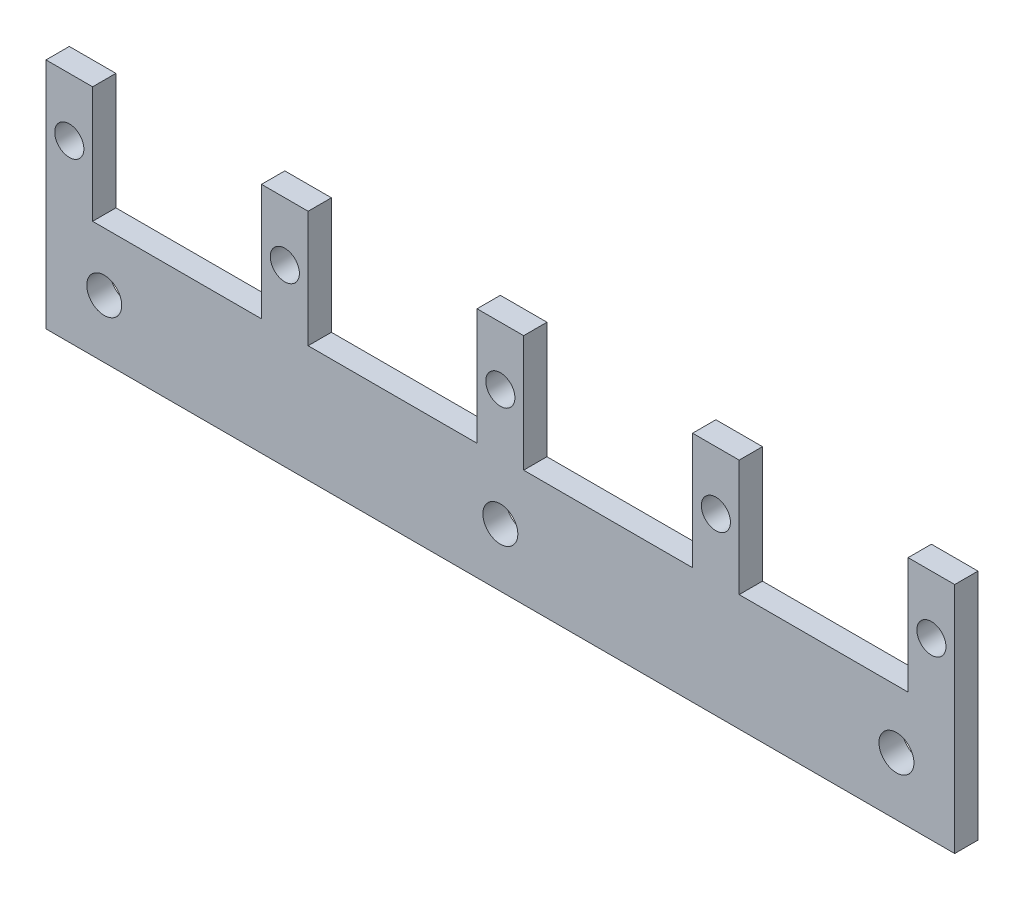
ISO-10303-21;
HEADER;
FILE_DESCRIPTION(('STEP AP214'),'2;1');
FILE_NAME('part.step','',(''),(''),'','','');
FILE_SCHEMA(('AUTOMOTIVE_DESIGN { 1 0 10303 214 1 1 1 1 }'));
ENDSEC;
DATA;
#1=APPLICATION_CONTEXT('core data for automotive mechanical design processes');
#2=APPLICATION_PROTOCOL_DEFINITION('international standard','automotive_design',2000,#1);
#3=PRODUCT_CONTEXT('',#1,'mechanical');
#4=PRODUCT('Part','Part','',(#3));
#5=PRODUCT_RELATED_PRODUCT_CATEGORY('part','',(#4));
#6=PRODUCT_DEFINITION_FORMATION('','',#4);
#7=PRODUCT_DEFINITION_CONTEXT('part definition',#1,'design');
#8=PRODUCT_DEFINITION('design','',#6,#7);
#9=PRODUCT_DEFINITION_SHAPE('','',#8);
#10=(LENGTH_UNIT() NAMED_UNIT(*) SI_UNIT(.MILLI.,.METRE.));
#11=(NAMED_UNIT(*) PLANE_ANGLE_UNIT() SI_UNIT($,.RADIAN.));
#12=(NAMED_UNIT(*) SI_UNIT($,.STERADIAN.) SOLID_ANGLE_UNIT());
#13=UNCERTAINTY_MEASURE_WITH_UNIT(LENGTH_MEASURE(1.E-05),#10,'distance_accuracy_value','');
#14=(GEOMETRIC_REPRESENTATION_CONTEXT(3) GLOBAL_UNCERTAINTY_ASSIGNED_CONTEXT((#13)) GLOBAL_UNIT_ASSIGNED_CONTEXT((#10,
#11,#12)) REPRESENTATION_CONTEXT('',''));
#15=CARTESIAN_POINT('',(0.,0.,0.));
#16=DIRECTION('',(0.,0.,1.));
#17=DIRECTION('',(1.,0.,0.));
#18=AXIS2_PLACEMENT_3D('',#15,#16,#17);
#19=CARTESIAN_POINT('',(102.,22.4427767354591,-2.));
#20=DIRECTION('',(0.,0.,1.));
#21=DIRECTION('',(1.,0.,0.));
#22=AXIS2_PLACEMENT_3D('',#19,#20,#21);
#23=CYLINDRICAL_SURFACE('',#22,2.5);
#24=CARTESIAN_POINT('',(102.,22.4427767354591,-2.));
#25=DIRECTION('',(0.,0.,1.));
#26=DIRECTION('',(1.,0.,0.));
#27=AXIS2_PLACEMENT_3D('',#24,#25,#26);
#28=CIRCLE('',#27,2.5);
#29=CARTESIAN_POINT('',(104.5,22.4427767354591,-2.));
#30=VERTEX_POINT('',#29);
#31=EDGE_CURVE('E54',#30,#30,#28,.T.);
#32=ORIENTED_EDGE('',*,*,#31,.F.);
#33=EDGE_LOOP('',(#32));
#34=FACE_BOUND('',#33,.T.);
#35=CARTESIAN_POINT('',(102.,22.4427767354591,2.));
#36=DIRECTION('',(0.,0.,1.));
#37=DIRECTION('',(1.,0.,0.));
#38=AXIS2_PLACEMENT_3D('',#35,#36,#37);
#39=CIRCLE('',#38,2.5);
#40=CARTESIAN_POINT('',(104.5,22.4427767354591,2.));
#41=VERTEX_POINT('',#40);
#42=EDGE_CURVE('E11',#41,#41,#39,.T.);
#43=ORIENTED_EDGE('',*,*,#42,.T.);
#44=EDGE_LOOP('',(#43));
#45=FACE_BOUND('',#44,.T.);
#46=ADVANCED_FACE('F45',(#34,#45),#23,.F.);
#47=CARTESIAN_POINT('',(65.,22.4427767354591,-2.));
#48=DIRECTION('',(0.,0.,1.));
#49=DIRECTION('',(1.,0.,0.));
#50=AXIS2_PLACEMENT_3D('',#47,#48,#49);
#51=CYLINDRICAL_SURFACE('',#50,2.5);
#52=CARTESIAN_POINT('',(65.,22.4427767354591,-2.));
#53=DIRECTION('',(0.,0.,1.));
#54=DIRECTION('',(1.,0.,0.));
#55=AXIS2_PLACEMENT_3D('',#52,#53,#54);
#56=CIRCLE('',#55,2.5);
#57=CARTESIAN_POINT('',(67.5,22.4427767354591,-2.));
#58=VERTEX_POINT('',#57);
#59=EDGE_CURVE('E352',#58,#58,#56,.T.);
#60=ORIENTED_EDGE('',*,*,#59,.F.);
#61=EDGE_LOOP('',(#60));
#62=FACE_BOUND('',#61,.T.);
#63=CARTESIAN_POINT('',(65.,22.4427767354591,2.));
#64=DIRECTION('',(0.,0.,1.));
#65=DIRECTION('',(1.,0.,0.));
#66=AXIS2_PLACEMENT_3D('',#63,#64,#65);
#67=CIRCLE('',#66,2.5);
#68=CARTESIAN_POINT('',(67.5,22.4427767354591,2.));
#69=VERTEX_POINT('',#68);
#70=EDGE_CURVE('E356',#69,#69,#67,.T.);
#71=ORIENTED_EDGE('',*,*,#70,.T.);
#72=EDGE_LOOP('',(#71));
#73=FACE_BOUND('',#72,.T.);
#74=ADVANCED_FACE('F367',(#62,#73),#51,.F.);
#75=CARTESIAN_POINT('',(28.,22.4427767354591,-2.));
#76=DIRECTION('',(0.,0.,1.));
#77=DIRECTION('',(1.,0.,0.));
#78=AXIS2_PLACEMENT_3D('',#75,#76,#77);
#79=CYLINDRICAL_SURFACE('',#78,2.5);
#80=CARTESIAN_POINT('',(28.,22.4427767354591,-2.));
#81=DIRECTION('',(0.,0.,1.));
#82=DIRECTION('',(1.,0.,0.));
#83=AXIS2_PLACEMENT_3D('',#80,#81,#82);
#84=CIRCLE('',#83,2.5);
#85=CARTESIAN_POINT('',(30.5,22.4427767354591,-2.));
#86=VERTEX_POINT('',#85);
#87=EDGE_CURVE('E344',#86,#86,#84,.T.);
#88=ORIENTED_EDGE('',*,*,#87,.F.);
#89=EDGE_LOOP('',(#88));
#90=FACE_BOUND('',#89,.T.);
#91=CARTESIAN_POINT('',(28.,22.4427767354591,2.));
#92=DIRECTION('',(0.,0.,1.));
#93=DIRECTION('',(1.,0.,0.));
#94=AXIS2_PLACEMENT_3D('',#91,#92,#93);
#95=CIRCLE('',#94,2.5);
#96=CARTESIAN_POINT('',(30.5,22.4427767354591,2.));
#97=VERTEX_POINT('',#96);
#98=EDGE_CURVE('E348',#97,#97,#95,.T.);
#99=ORIENTED_EDGE('',*,*,#98,.T.);
#100=EDGE_LOOP('',(#99));
#101=FACE_BOUND('',#100,.T.);
#102=ADVANCED_FACE('F448',(#90,#101),#79,.F.);
#103=CARTESIAN_POINT('',(0.,-7.55722326454034,2.));
#104=DIRECTION('',(0.,1.,0.));
#105=DIRECTION('',(0.,0.,1.));
#106=AXIS2_PLACEMENT_3D('',#103,#104,#105);
#107=PLANE('',#106);
#108=DIRECTION('',(1.,0.,0.));
#109=VECTOR('',#108,1.);
#110=CARTESIAN_POINT('',(0.,-7.55722326454034,-2.));
#111=LINE('',#110,#109);
#112=CARTESIAN_POINT('',(-50.,-7.55722326454034,-2.));
#113=VERTEX_POINT('',#112);
#114=CARTESIAN_POINT('',(106.,-7.55722326454034,-2.));
#115=VERTEX_POINT('',#114);
#116=EDGE_CURVE('E221',#113,#115,#111,.T.);
#117=ORIENTED_EDGE('',*,*,#116,.T.);
#118=DIRECTION('',(0.,0.,-1.));
#119=VECTOR('',#118,1.);
#120=CARTESIAN_POINT('',(106.,-7.55722326454034,2.));
#121=LINE('',#120,#119);
#122=CARTESIAN_POINT('',(106.,-7.55722326454034,2.));
#123=VERTEX_POINT('',#122);
#124=EDGE_CURVE('E341',#123,#115,#121,.T.);
#125=ORIENTED_EDGE('',*,*,#124,.F.);
#126=DIRECTION('',(1.,0.,0.));
#127=VECTOR('',#126,1.);
#128=CARTESIAN_POINT('',(0.,-7.55722326454034,2.));
#129=LINE('',#128,#127);
#130=CARTESIAN_POINT('',(-50.,-7.55722326454034,2.));
#131=VERTEX_POINT('',#130);
#132=EDGE_CURVE('E285',#131,#123,#129,.T.);
#133=ORIENTED_EDGE('',*,*,#132,.F.);
#134=DIRECTION('',(0.,0.,-1.));
#135=VECTOR('',#134,1.);
#136=CARTESIAN_POINT('',(-50.,-7.55722326454034,2.));
#137=LINE('',#136,#135);
#138=EDGE_CURVE('E62',#131,#113,#137,.T.);
#139=ORIENTED_EDGE('',*,*,#138,.T.);
#140=EDGE_LOOP('',(#117,#125,#133,#139));
#141=FACE_BOUND('',#140,.T.);
#142=ADVANCED_FACE('F445',(#141),#107,.F.);
#143=CARTESIAN_POINT('',(106.,0.,2.));
#144=DIRECTION('',(-1.,0.,0.));
#145=DIRECTION('',(0.,0.,1.));
#146=AXIS2_PLACEMENT_3D('',#143,#144,#145);
#147=PLANE('',#146);
#148=DIRECTION('',(0.,1.,0.));
#149=VECTOR('',#148,1.);
#150=CARTESIAN_POINT('',(106.,0.,-2.));
#151=LINE('',#150,#149);
#152=CARTESIAN_POINT('',(106.,32.4427767354597,-2.));
#153=VERTEX_POINT('',#152);
#154=EDGE_CURVE('E224',#115,#153,#151,.T.);
#155=ORIENTED_EDGE('',*,*,#154,.T.);
#156=DIRECTION('',(0.,0.,-1.));
#157=VECTOR('',#156,1.);
#158=CARTESIAN_POINT('',(106.,32.4427767354597,2.));
#159=LINE('',#158,#157);
#160=CARTESIAN_POINT('',(106.,32.4427767354597,2.));
#161=VERTEX_POINT('',#160);
#162=EDGE_CURVE('E337',#161,#153,#159,.T.);
#163=ORIENTED_EDGE('',*,*,#162,.F.);
#164=DIRECTION('',(0.,1.,0.));
#165=VECTOR('',#164,1.);
#166=CARTESIAN_POINT('',(106.,0.,2.));
#167=LINE('',#166,#165);
#168=EDGE_CURVE('E138',#123,#161,#167,.T.);
#169=ORIENTED_EDGE('',*,*,#168,.F.);
#170=ORIENTED_EDGE('',*,*,#124,.T.);
#171=EDGE_LOOP('',(#155,#163,#169,#170));
#172=FACE_BOUND('',#171,.T.);
#173=ADVANCED_FACE('F441',(#172),#147,.F.);
#174=CARTESIAN_POINT('',(0.,32.4427767354597,2.));
#175=DIRECTION('',(0.,-1.,0.));
#176=DIRECTION('',(0.,0.,-1.));
#177=AXIS2_PLACEMENT_3D('',#174,#175,#176);
#178=PLANE('',#177);
#179=DIRECTION('',(-1.,0.,0.));
#180=VECTOR('',#179,1.);
#181=CARTESIAN_POINT('',(0.,32.4427767354597,-2.));
#182=LINE('',#181,#180);
#183=CARTESIAN_POINT('',(98.,32.4427767354597,-2.));
#184=VERTEX_POINT('',#183);
#185=EDGE_CURVE('E228',#153,#184,#182,.T.);
#186=ORIENTED_EDGE('',*,*,#185,.T.);
#187=DIRECTION('',(0.,0.,-1.));
#188=VECTOR('',#187,1.);
#189=CARTESIAN_POINT('',(98.,32.4427767354597,2.));
#190=LINE('',#189,#188);
#191=CARTESIAN_POINT('',(98.,32.4427767354597,2.));
#192=VERTEX_POINT('',#191);
#193=EDGE_CURVE('E334',#192,#184,#190,.T.);
#194=ORIENTED_EDGE('',*,*,#193,.F.);
#195=DIRECTION('',(-1.,0.,0.));
#196=VECTOR('',#195,1.);
#197=CARTESIAN_POINT('',(0.,32.4427767354597,2.));
#198=LINE('',#197,#196);
#199=EDGE_CURVE('E674',#161,#192,#198,.T.);
#200=ORIENTED_EDGE('',*,*,#199,.F.);
#201=ORIENTED_EDGE('',*,*,#162,.T.);
#202=EDGE_LOOP('',(#186,#194,#200,#201));
#203=FACE_BOUND('',#202,.T.);
#204=ADVANCED_FACE('F437',(#203),#178,.F.);
#205=CARTESIAN_POINT('',(98.,0.,2.));
#206=DIRECTION('',(-1.,0.,0.));
#207=DIRECTION('',(0.,0.,1.));
#208=AXIS2_PLACEMENT_3D('',#205,#206,#207);
#209=PLANE('',#208);
#210=DIRECTION('',(0.,1.,0.));
#211=VECTOR('',#210,1.);
#212=CARTESIAN_POINT('',(98.,0.,-2.));
#213=LINE('',#212,#211);
#214=CARTESIAN_POINT('',(98.,12.4427767354597,-2.));
#215=VERTEX_POINT('',#214);
#216=EDGE_CURVE('E232',#215,#184,#213,.T.);
#217=ORIENTED_EDGE('',*,*,#216,.F.);
#218=DIRECTION('',(0.,0.,-1.));
#219=VECTOR('',#218,1.);
#220=CARTESIAN_POINT('',(98.,12.4427767354597,2.));
#221=LINE('',#220,#219);
#222=CARTESIAN_POINT('',(98.,12.4427767354597,2.));
#223=VERTEX_POINT('',#222);
#224=EDGE_CURVE('E331',#223,#215,#221,.T.);
#225=ORIENTED_EDGE('',*,*,#224,.F.);
#226=DIRECTION('',(0.,1.,0.));
#227=VECTOR('',#226,1.);
#228=CARTESIAN_POINT('',(98.,0.,2.));
#229=LINE('',#228,#227);
#230=EDGE_CURVE('E677',#223,#192,#229,.T.);
#231=ORIENTED_EDGE('',*,*,#230,.T.);
#232=ORIENTED_EDGE('',*,*,#193,.T.);
#233=EDGE_LOOP('',(#217,#225,#231,#232));
#234=FACE_BOUND('',#233,.T.);
#235=ADVANCED_FACE('F434',(#234),#209,.T.);
#236=CARTESIAN_POINT('',(0.,12.4427767354596,2.));
#237=DIRECTION('',(0.,1.,0.));
#238=DIRECTION('',(-1.,0.,0.));
#239=AXIS2_PLACEMENT_3D('',#236,#237,#238);
#240=PLANE('',#239);
#241=DIRECTION('',(1.,0.,0.));
#242=VECTOR('',#241,1.);
#243=CARTESIAN_POINT('',(0.,12.4427767354596,-2.));
#244=LINE('',#243,#242);
#245=CARTESIAN_POINT('',(69.,12.4427767354595,-2.));
#246=VERTEX_POINT('',#245);
#247=EDGE_CURVE('E236',#246,#215,#244,.T.);
#248=ORIENTED_EDGE('',*,*,#247,.F.);
#249=DIRECTION('',(0.,0.,-1.));
#250=VECTOR('',#249,1.);
#251=CARTESIAN_POINT('',(69.,12.4427767354595,2.));
#252=LINE('',#251,#250);
#253=CARTESIAN_POINT('',(69.,12.4427767354595,2.));
#254=VERTEX_POINT('',#253);
#255=EDGE_CURVE('E328',#254,#246,#252,.T.);
#256=ORIENTED_EDGE('',*,*,#255,.F.);
#257=DIRECTION('',(1.,0.,0.));
#258=VECTOR('',#257,1.);
#259=CARTESIAN_POINT('',(0.,12.4427767354596,2.));
#260=LINE('',#259,#258);
#261=EDGE_CURVE('E681',#254,#223,#260,.T.);
#262=ORIENTED_EDGE('',*,*,#261,.T.);
#263=ORIENTED_EDGE('',*,*,#224,.T.);
#264=EDGE_LOOP('',(#248,#256,#262,#263));
#265=FACE_BOUND('',#264,.T.);
#266=ADVANCED_FACE('F396',(#265),#240,.T.);
#267=CARTESIAN_POINT('',(69.,0.,2.));
#268=DIRECTION('',(-1.,0.,0.));
#269=DIRECTION('',(0.,0.,1.));
#270=AXIS2_PLACEMENT_3D('',#267,#268,#269);
#271=PLANE('',#270);
#272=DIRECTION('',(0.,1.,0.));
#273=VECTOR('',#272,1.);
#274=CARTESIAN_POINT('',(69.,0.,-2.));
#275=LINE('',#274,#273);
#276=CARTESIAN_POINT('',(69.,32.4427767354594,-2.));
#277=VERTEX_POINT('',#276);
#278=EDGE_CURVE('E240',#246,#277,#275,.T.);
#279=ORIENTED_EDGE('',*,*,#278,.T.);
#280=DIRECTION('',(0.,0.,-1.));
#281=VECTOR('',#280,1.);
#282=CARTESIAN_POINT('',(69.,32.4427767354594,2.));
#283=LINE('',#282,#281);
#284=CARTESIAN_POINT('',(69.,32.4427767354594,2.));
#285=VERTEX_POINT('',#284);
#286=EDGE_CURVE('E324',#285,#277,#283,.T.);
#287=ORIENTED_EDGE('',*,*,#286,.F.);
#288=DIRECTION('',(0.,1.,0.));
#289=VECTOR('',#288,1.);
#290=CARTESIAN_POINT('',(69.,0.,2.));
#291=LINE('',#290,#289);
#292=EDGE_CURVE('E685',#254,#285,#291,.T.);
#293=ORIENTED_EDGE('',*,*,#292,.F.);
#294=ORIENTED_EDGE('',*,*,#255,.T.);
#295=EDGE_LOOP('',(#279,#287,#293,#294));
#296=FACE_BOUND('',#295,.T.);
#297=ADVANCED_FACE('F429',(#296),#271,.F.);
#298=CARTESIAN_POINT('',(0.,32.4427767354594,2.));
#299=DIRECTION('',(0.,-1.,0.));
#300=DIRECTION('',(0.,0.,-1.));
#301=AXIS2_PLACEMENT_3D('',#298,#299,#300);
#302=PLANE('',#301);
#303=DIRECTION('',(-1.,0.,0.));
#304=VECTOR('',#303,1.);
#305=CARTESIAN_POINT('',(0.,32.4427767354594,-2.));
#306=LINE('',#305,#304);
#307=CARTESIAN_POINT('',(61.,32.4427767354594,-2.));
#308=VERTEX_POINT('',#307);
#309=EDGE_CURVE('E245',#277,#308,#306,.T.);
#310=ORIENTED_EDGE('',*,*,#309,.T.);
#311=DIRECTION('',(0.,0.,-1.));
#312=VECTOR('',#311,1.);
#313=CARTESIAN_POINT('',(61.,32.4427767354594,2.));
#314=LINE('',#313,#312);
#315=CARTESIAN_POINT('',(61.,32.4427767354594,2.));
#316=VERTEX_POINT('',#315);
#317=EDGE_CURVE('E321',#316,#308,#314,.T.);
#318=ORIENTED_EDGE('',*,*,#317,.F.);
#319=DIRECTION('',(-1.,0.,0.));
#320=VECTOR('',#319,1.);
#321=CARTESIAN_POINT('',(0.,32.4427767354594,2.));
#322=LINE('',#321,#320);
#323=EDGE_CURVE('E689',#285,#316,#322,.T.);
#324=ORIENTED_EDGE('',*,*,#323,.F.);
#325=ORIENTED_EDGE('',*,*,#286,.T.);
#326=EDGE_LOOP('',(#310,#318,#324,#325));
#327=FACE_BOUND('',#326,.T.);
#328=ADVANCED_FACE('F425',(#327),#302,.F.);
#329=CARTESIAN_POINT('',(61.,0.,2.));
#330=DIRECTION('',(-1.,0.,0.));
#331=DIRECTION('',(0.,-1.,0.));
#332=AXIS2_PLACEMENT_3D('',#329,#330,#331);
#333=PLANE('',#332);
#334=DIRECTION('',(0.,1.,0.));
#335=VECTOR('',#334,1.);
#336=CARTESIAN_POINT('',(61.,0.,-2.));
#337=LINE('',#336,#335);
#338=CARTESIAN_POINT('',(61.,12.4427767354597,-2.));
#339=VERTEX_POINT('',#338);
#340=EDGE_CURVE('E249',#339,#308,#337,.T.);
#341=ORIENTED_EDGE('',*,*,#340,.F.);
#342=DIRECTION('',(0.,0.,-1.));
#343=VECTOR('',#342,1.);
#344=CARTESIAN_POINT('',(61.,12.4427767354597,2.));
#345=LINE('',#344,#343);
#346=CARTESIAN_POINT('',(61.,12.4427767354597,2.));
#347=VERTEX_POINT('',#346);
#348=EDGE_CURVE('E318',#347,#339,#345,.T.);
#349=ORIENTED_EDGE('',*,*,#348,.F.);
#350=DIRECTION('',(0.,1.,0.));
#351=VECTOR('',#350,1.);
#352=CARTESIAN_POINT('',(61.,0.,2.));
#353=LINE('',#352,#351);
#354=EDGE_CURVE('E692',#347,#316,#353,.T.);
#355=ORIENTED_EDGE('',*,*,#354,.T.);
#356=ORIENTED_EDGE('',*,*,#317,.T.);
#357=EDGE_LOOP('',(#341,#349,#355,#356));
#358=FACE_BOUND('',#357,.T.);
#359=ADVANCED_FACE('F422',(#358),#333,.T.);
#360=CARTESIAN_POINT('',(32.,12.4427767354597,-2.));
#361=VERTEX_POINT('',#360);
#362=EDGE_CURVE('E242',#361,#339,#244,.T.);
#363=ORIENTED_EDGE('',*,*,#362,.F.);
#364=DIRECTION('',(0.,0.,-1.));
#365=VECTOR('',#364,1.);
#366=CARTESIAN_POINT('',(32.,12.4427767354597,2.));
#367=LINE('',#366,#365);
#368=CARTESIAN_POINT('',(32.,12.4427767354597,2.));
#369=VERTEX_POINT('',#368);
#370=EDGE_CURVE('E315',#369,#361,#367,.T.);
#371=ORIENTED_EDGE('',*,*,#370,.F.);
#372=EDGE_CURVE('E686',#369,#347,#260,.T.);
#373=ORIENTED_EDGE('',*,*,#372,.T.);
#374=ORIENTED_EDGE('',*,*,#348,.T.);
#375=EDGE_LOOP('',(#363,#371,#373,#374));
#376=FACE_BOUND('',#375,.T.);
#377=ADVANCED_FACE('F420',(#376),#240,.T.);
#378=CARTESIAN_POINT('',(32.,0.,2.));
#379=DIRECTION('',(-1.,0.,0.));
#380=DIRECTION('',(0.,-1.,0.));
#381=AXIS2_PLACEMENT_3D('',#378,#379,#380);
#382=PLANE('',#381);
#383=DIRECTION('',(0.,1.,0.));
#384=VECTOR('',#383,1.);
#385=CARTESIAN_POINT('',(32.,0.,-2.));
#386=LINE('',#385,#384);
#387=CARTESIAN_POINT('',(32.,32.4427767354591,-2.));
#388=VERTEX_POINT('',#387);
#389=EDGE_CURVE('E253',#361,#388,#386,.T.);
#390=ORIENTED_EDGE('',*,*,#389,.T.);
#391=DIRECTION('',(0.,0.,-1.));
#392=VECTOR('',#391,1.);
#393=CARTESIAN_POINT('',(32.,32.4427767354591,2.));
#394=LINE('',#393,#392);
#395=CARTESIAN_POINT('',(32.,32.4427767354591,2.));
#396=VERTEX_POINT('',#395);
#397=EDGE_CURVE('E311',#396,#388,#394,.T.);
#398=ORIENTED_EDGE('',*,*,#397,.F.);
#399=DIRECTION('',(0.,1.,0.));
#400=VECTOR('',#399,1.);
#401=CARTESIAN_POINT('',(32.,0.,2.));
#402=LINE('',#401,#400);
#403=EDGE_CURVE('E696',#369,#396,#402,.T.);
#404=ORIENTED_EDGE('',*,*,#403,.F.);
#405=ORIENTED_EDGE('',*,*,#370,.T.);
#406=EDGE_LOOP('',(#390,#398,#404,#405));
#407=FACE_BOUND('',#406,.T.);
#408=ADVANCED_FACE('F416',(#407),#382,.F.);
#409=CARTESIAN_POINT('',(0.,32.4427767354591,2.));
#410=DIRECTION('',(0.,-1.,0.));
#411=DIRECTION('',(0.,0.,-1.));
#412=AXIS2_PLACEMENT_3D('',#409,#410,#411);
#413=PLANE('',#412);
#414=DIRECTION('',(-1.,0.,0.));
#415=VECTOR('',#414,1.);
#416=CARTESIAN_POINT('',(0.,32.4427767354591,-2.));
#417=LINE('',#416,#415);
#418=CARTESIAN_POINT('',(24.,32.4427767354591,-2.));
#419=VERTEX_POINT('',#418);
#420=EDGE_CURVE('E256',#388,#419,#417,.T.);
#421=ORIENTED_EDGE('',*,*,#420,.T.);
#422=DIRECTION('',(0.,0.,-1.));
#423=VECTOR('',#422,1.);
#424=CARTESIAN_POINT('',(24.,32.4427767354591,2.));
#425=LINE('',#424,#423);
#426=CARTESIAN_POINT('',(24.,32.4427767354591,2.));
#427=VERTEX_POINT('',#426);
#428=EDGE_CURVE('E308',#427,#419,#425,.T.);
#429=ORIENTED_EDGE('',*,*,#428,.F.);
#430=DIRECTION('',(-1.,0.,0.));
#431=VECTOR('',#430,1.);
#432=CARTESIAN_POINT('',(0.,32.4427767354591,2.));
#433=LINE('',#432,#431);
#434=EDGE_CURVE('E699',#396,#427,#433,.T.);
#435=ORIENTED_EDGE('',*,*,#434,.F.);
#436=ORIENTED_EDGE('',*,*,#397,.T.);
#437=EDGE_LOOP('',(#421,#429,#435,#436));
#438=FACE_BOUND('',#437,.T.);
#439=ADVANCED_FACE('F412',(#438),#413,.F.);
#440=CARTESIAN_POINT('',(24.,0.,2.));
#441=DIRECTION('',(-1.,0.,0.));
#442=DIRECTION('',(0.,-1.,0.));
#443=AXIS2_PLACEMENT_3D('',#440,#441,#442);
#444=PLANE('',#443);
#445=DIRECTION('',(0.,1.,0.));
#446=VECTOR('',#445,1.);
#447=CARTESIAN_POINT('',(24.,0.,-2.));
#448=LINE('',#447,#446);
#449=CARTESIAN_POINT('',(24.,12.4427767354597,-2.));
#450=VERTEX_POINT('',#449);
#451=EDGE_CURVE('E260',#450,#419,#448,.T.);
#452=ORIENTED_EDGE('',*,*,#451,.F.);
#453=DIRECTION('',(0.,0.,-1.));
#454=VECTOR('',#453,1.);
#455=CARTESIAN_POINT('',(24.,12.4427767354597,2.));
#456=LINE('',#455,#454);
#457=CARTESIAN_POINT('',(24.,12.4427767354597,2.));
#458=VERTEX_POINT('',#457);
#459=EDGE_CURVE('E305',#458,#450,#456,.T.);
#460=ORIENTED_EDGE('',*,*,#459,.F.);
#461=DIRECTION('',(0.,1.,0.));
#462=VECTOR('',#461,1.);
#463=CARTESIAN_POINT('',(24.,0.,2.));
#464=LINE('',#463,#462);
#465=EDGE_CURVE('E702',#458,#427,#464,.T.);
#466=ORIENTED_EDGE('',*,*,#465,.T.);
#467=ORIENTED_EDGE('',*,*,#428,.T.);
#468=EDGE_LOOP('',(#452,#460,#466,#467));
#469=FACE_BOUND('',#468,.T.);
#470=ADVANCED_FACE('F409',(#469),#444,.T.);
#471=CARTESIAN_POINT('',(-4.99999999999998,12.4427767354596,-2.));
#472=VERTEX_POINT('',#471);
#473=EDGE_CURVE('E264',#472,#450,#244,.T.);
#474=ORIENTED_EDGE('',*,*,#473,.F.);
#475=DIRECTION('',(0.,0.,-1.));
#476=VECTOR('',#475,1.);
#477=CARTESIAN_POINT('',(-4.99999999999998,12.4427767354596,2.));
#478=LINE('',#477,#476);
#479=CARTESIAN_POINT('',(-4.99999999999998,12.4427767354596,2.));
#480=VERTEX_POINT('',#479);
#481=EDGE_CURVE('E302',#480,#472,#478,.T.);
#482=ORIENTED_EDGE('',*,*,#481,.F.);
#483=EDGE_CURVE('E706',#480,#458,#260,.T.);
#484=ORIENTED_EDGE('',*,*,#483,.T.);
#485=ORIENTED_EDGE('',*,*,#459,.T.);
#486=EDGE_LOOP('',(#474,#482,#484,#485));
#487=FACE_BOUND('',#486,.T.);
#488=ADVANCED_FACE('F397',(#487),#240,.T.);
#489=CARTESIAN_POINT('',(-5.,0.,2.));
#490=DIRECTION('',(-1.,0.,0.));
#491=DIRECTION('',(0.,-1.,0.));
#492=AXIS2_PLACEMENT_3D('',#489,#490,#491);
#493=PLANE('',#492);
#494=DIRECTION('',(0.,1.,0.));
#495=VECTOR('',#494,1.);
#496=CARTESIAN_POINT('',(-5.,0.,-2.));
#497=LINE('',#496,#495);
#498=CARTESIAN_POINT('',(-4.99999999999998,32.4427767354589,-2.));
#499=VERTEX_POINT('',#498);
#500=EDGE_CURVE('E265',#472,#499,#497,.T.);
#501=ORIENTED_EDGE('',*,*,#500,.T.);
#502=DIRECTION('',(0.,0.,-1.));
#503=VECTOR('',#502,1.);
#504=CARTESIAN_POINT('',(-4.99999999999998,32.4427767354589,2.));
#505=LINE('',#504,#503);
#506=CARTESIAN_POINT('',(-4.99999999999998,32.4427767354589,2.));
#507=VERTEX_POINT('',#506);
#508=EDGE_CURVE('E298',#507,#499,#505,.T.);
#509=ORIENTED_EDGE('',*,*,#508,.F.);
#510=DIRECTION('',(0.,1.,0.));
#511=VECTOR('',#510,1.);
#512=CARTESIAN_POINT('',(-5.,0.,2.));
#513=LINE('',#512,#511);
#514=EDGE_CURVE('E707',#480,#507,#513,.T.);
#515=ORIENTED_EDGE('',*,*,#514,.F.);
#516=ORIENTED_EDGE('',*,*,#481,.T.);
#517=EDGE_LOOP('',(#501,#509,#515,#516));
#518=FACE_BOUND('',#517,.T.);
#519=ADVANCED_FACE('F404',(#518),#493,.F.);
#520=CARTESIAN_POINT('',(0.,32.4427767354589,2.));
#521=DIRECTION('',(0.,-1.,0.));
#522=DIRECTION('',(0.,0.,-1.));
#523=AXIS2_PLACEMENT_3D('',#520,#521,#522);
#524=PLANE('',#523);
#525=DIRECTION('',(-1.,0.,0.));
#526=VECTOR('',#525,1.);
#527=CARTESIAN_POINT('',(0.,32.4427767354589,-2.));
#528=LINE('',#527,#526);
#529=CARTESIAN_POINT('',(-13.,32.4427767354589,-2.));
#530=VERTEX_POINT('',#529);
#531=EDGE_CURVE('E268',#499,#530,#528,.T.);
#532=ORIENTED_EDGE('',*,*,#531,.T.);
#533=DIRECTION('',(0.,0.,-1.));
#534=VECTOR('',#533,1.);
#535=CARTESIAN_POINT('',(-13.,32.4427767354589,2.));
#536=LINE('',#535,#534);
#537=CARTESIAN_POINT('',(-13.,32.4427767354589,2.));
#538=VERTEX_POINT('',#537);
#539=EDGE_CURVE('E295',#538,#530,#536,.T.);
#540=ORIENTED_EDGE('',*,*,#539,.F.);
#541=DIRECTION('',(-1.,0.,0.));
#542=VECTOR('',#541,1.);
#543=CARTESIAN_POINT('',(0.,32.4427767354589,2.));
#544=LINE('',#543,#542);
#545=EDGE_CURVE('E710',#507,#538,#544,.T.);
#546=ORIENTED_EDGE('',*,*,#545,.F.);
#547=ORIENTED_EDGE('',*,*,#508,.T.);
#548=EDGE_LOOP('',(#532,#540,#546,#547));
#549=FACE_BOUND('',#548,.T.);
#550=ADVANCED_FACE('F400',(#549),#524,.F.);
#551=CARTESIAN_POINT('',(-13.,0.,2.));
#552=DIRECTION('',(-1.,0.,0.));
#553=DIRECTION('',(0.,-1.,0.));
#554=AXIS2_PLACEMENT_3D('',#551,#552,#553);
#555=PLANE('',#554);
#556=DIRECTION('',(0.,1.,0.));
#557=VECTOR('',#556,1.);
#558=CARTESIAN_POINT('',(-13.,0.,-2.));
#559=LINE('',#558,#557);
#560=CARTESIAN_POINT('',(-13.,12.4427767354596,-2.));
#561=VERTEX_POINT('',#560);
#562=EDGE_CURVE('E272',#561,#530,#559,.T.);
#563=ORIENTED_EDGE('',*,*,#562,.F.);
#564=DIRECTION('',(0.,0.,-1.));
#565=VECTOR('',#564,1.);
#566=CARTESIAN_POINT('',(-13.,12.4427767354596,2.));
#567=LINE('',#566,#565);
#568=CARTESIAN_POINT('',(-13.,12.4427767354596,2.));
#569=VERTEX_POINT('',#568);
#570=EDGE_CURVE('E292',#569,#561,#567,.T.);
#571=ORIENTED_EDGE('',*,*,#570,.F.);
#572=DIRECTION('',(0.,1.,0.));
#573=VECTOR('',#572,1.);
#574=CARTESIAN_POINT('',(-13.,0.,2.));
#575=LINE('',#574,#573);
#576=EDGE_CURVE('E712',#569,#538,#575,.T.);
#577=ORIENTED_EDGE('',*,*,#576,.T.);
#578=ORIENTED_EDGE('',*,*,#539,.T.);
#579=EDGE_LOOP('',(#563,#571,#577,#578));
#580=FACE_BOUND('',#579,.T.);
#581=ADVANCED_FACE('F394',(#580),#555,.T.);
#582=CARTESIAN_POINT('',(-42.,12.4427767354596,-2.));
#583=VERTEX_POINT('',#582);
#584=EDGE_CURVE('E241',#583,#561,#244,.T.);
#585=ORIENTED_EDGE('',*,*,#584,.F.);
#586=DIRECTION('',(0.,0.,-1.));
#587=VECTOR('',#586,1.);
#588=CARTESIAN_POINT('',(-42.,12.4427767354596,2.));
#589=LINE('',#588,#587);
#590=CARTESIAN_POINT('',(-42.,12.4427767354596,2.));
#591=VERTEX_POINT('',#590);
#592=EDGE_CURVE('E211',#591,#583,#589,.T.);
#593=ORIENTED_EDGE('',*,*,#592,.F.);
#594=EDGE_CURVE('E199',#591,#569,#260,.T.);
#595=ORIENTED_EDGE('',*,*,#594,.T.);
#596=ORIENTED_EDGE('',*,*,#570,.T.);
#597=EDGE_LOOP('',(#585,#593,#595,#596));
#598=FACE_BOUND('',#597,.T.);
#599=ADVANCED_FACE('F391',(#598),#240,.T.);
#600=CARTESIAN_POINT('',(-42.,0.,2.));
#601=DIRECTION('',(-1.,0.,0.));
#602=DIRECTION('',(0.,-1.,0.));
#603=AXIS2_PLACEMENT_3D('',#600,#601,#602);
#604=PLANE('',#603);
#605=DIRECTION('',(0.,1.,0.));
#606=VECTOR('',#605,1.);
#607=CARTESIAN_POINT('',(-42.,0.,-2.));
#608=LINE('',#607,#606);
#609=CARTESIAN_POINT('',(-42.,32.4427767354586,-2.));
#610=VERTEX_POINT('',#609);
#611=EDGE_CURVE('E207',#583,#610,#608,.T.);
#612=ORIENTED_EDGE('',*,*,#611,.T.);
#613=DIRECTION('',(0.,0.,-1.));
#614=VECTOR('',#613,1.);
#615=CARTESIAN_POINT('',(-42.,32.4427767354586,2.));
#616=LINE('',#615,#614);
#617=CARTESIAN_POINT('',(-42.,32.4427767354586,2.));
#618=VERTEX_POINT('',#617);
#619=EDGE_CURVE('E204',#618,#610,#616,.T.);
#620=ORIENTED_EDGE('',*,*,#619,.F.);
#621=DIRECTION('',(0.,1.,0.));
#622=VECTOR('',#621,1.);
#623=CARTESIAN_POINT('',(-42.,0.,2.));
#624=LINE('',#623,#622);
#625=EDGE_CURVE('E190',#591,#618,#624,.T.);
#626=ORIENTED_EDGE('',*,*,#625,.F.);
#627=ORIENTED_EDGE('',*,*,#592,.T.);
#628=EDGE_LOOP('',(#612,#620,#626,#627));
#629=FACE_BOUND('',#628,.T.);
#630=ADVANCED_FACE('F205',(#629),#604,.F.);
#631=CARTESIAN_POINT('',(0.,32.4427767354586,2.));
#632=DIRECTION('',(0.,-1.,0.));
#633=DIRECTION('',(0.,0.,-1.));
#634=AXIS2_PLACEMENT_3D('',#631,#632,#633);
#635=PLANE('',#634);
#636=DIRECTION('',(-1.,0.,0.));
#637=VECTOR('',#636,1.);
#638=CARTESIAN_POINT('',(0.,32.4427767354586,-2.));
#639=LINE('',#638,#637);
#640=CARTESIAN_POINT('',(-50.,32.4427767354586,-2.));
#641=VERTEX_POINT('',#640);
#642=EDGE_CURVE('E278',#610,#641,#639,.T.);
#643=ORIENTED_EDGE('',*,*,#642,.T.);
#644=DIRECTION('',(0.,0.,-1.));
#645=VECTOR('',#644,1.);
#646=CARTESIAN_POINT('',(-50.,32.4427767354586,2.));
#647=LINE('',#646,#645);
#648=CARTESIAN_POINT('',(-50.,32.4427767354586,2.));
#649=VERTEX_POINT('',#648);
#650=EDGE_CURVE('E125',#649,#641,#647,.T.);
#651=ORIENTED_EDGE('',*,*,#650,.F.);
#652=DIRECTION('',(-1.,0.,0.));
#653=VECTOR('',#652,1.);
#654=CARTESIAN_POINT('',(0.,32.4427767354586,2.));
#655=LINE('',#654,#653);
#656=EDGE_CURVE('E196',#618,#649,#655,.T.);
#657=ORIENTED_EDGE('',*,*,#656,.F.);
#658=ORIENTED_EDGE('',*,*,#619,.T.);
#659=EDGE_LOOP('',(#643,#651,#657,#658));
#660=FACE_BOUND('',#659,.T.);
#661=ADVANCED_FACE('F213',(#660),#635,.F.);
#662=CARTESIAN_POINT('',(-50.,0.,2.));
#663=DIRECTION('',(-1.,0.,0.));
#664=DIRECTION('',(0.,0.,1.));
#665=AXIS2_PLACEMENT_3D('',#662,#663,#664);
#666=PLANE('',#665);
#667=DIRECTION('',(0.,1.,0.));
#668=VECTOR('',#667,1.);
#669=CARTESIAN_POINT('',(-50.,0.,-2.));
#670=LINE('',#669,#668);
#671=EDGE_CURVE('E281',#113,#641,#670,.T.);
#672=ORIENTED_EDGE('',*,*,#671,.F.);
#673=ORIENTED_EDGE('',*,*,#138,.F.);
#674=DIRECTION('',(0.,1.,0.));
#675=VECTOR('',#674,1.);
#676=CARTESIAN_POINT('',(-50.,0.,2.));
#677=LINE('',#676,#675);
#678=EDGE_CURVE('E215',#131,#649,#677,.T.);
#679=ORIENTED_EDGE('',*,*,#678,.T.);
#680=ORIENTED_EDGE('',*,*,#650,.T.);
#681=EDGE_LOOP('',(#672,#673,#679,#680));
#682=FACE_BOUND('',#681,.T.);
#683=ADVANCED_FACE('F371',(#682),#666,.T.);
#684=CARTESIAN_POINT('',(0.,0.,2.));
#685=DIRECTION('',(0.,0.,1.));
#686=DIRECTION('',(1.,0.,0.));
#687=AXIS2_PLACEMENT_3D('',#684,#685,#686);
#688=PLANE('',#687);
#689=CARTESIAN_POINT('',(-40.,2.44277673545966,2.));
#690=DIRECTION('',(0.,0.,1.));
#691=DIRECTION('',(1.,0.,0.));
#692=AXIS2_PLACEMENT_3D('',#689,#690,#691);
#693=CIRCLE('',#692,3.);
#694=CARTESIAN_POINT('',(-37.,2.44277673545966,2.));
#695=VERTEX_POINT('',#694);
#696=EDGE_CURVE('E635',#695,#695,#693,.T.);
#697=ORIENTED_EDGE('',*,*,#696,.F.);
#698=EDGE_LOOP('',(#697));
#699=FACE_BOUND('',#698,.T.);
#700=CARTESIAN_POINT('',(96.,2.44277673545966,2.));
#701=DIRECTION('',(0.,0.,1.));
#702=DIRECTION('',(1.,0.,0.));
#703=AXIS2_PLACEMENT_3D('',#700,#701,#702);
#704=CIRCLE('',#703,3.00000000000001);
#705=CARTESIAN_POINT('',(99.,2.44277673545966,2.));
#706=VERTEX_POINT('',#705);
#707=EDGE_CURVE('E642',#706,#706,#704,.T.);
#708=ORIENTED_EDGE('',*,*,#707,.F.);
#709=EDGE_LOOP('',(#708));
#710=FACE_BOUND('',#709,.T.);
#711=CARTESIAN_POINT('',(28.,2.44277673545966,2.));
#712=DIRECTION('',(0.,0.,1.));
#713=DIRECTION('',(1.,0.,0.));
#714=AXIS2_PLACEMENT_3D('',#711,#712,#713);
#715=CIRCLE('',#714,3.);
#716=CARTESIAN_POINT('',(31.,2.44277673545966,2.));
#717=VERTEX_POINT('',#716);
#718=EDGE_CURVE('E652',#717,#717,#715,.T.);
#719=ORIENTED_EDGE('',*,*,#718,.F.);
#720=EDGE_LOOP('',(#719));
#721=FACE_BOUND('',#720,.T.);
#722=CARTESIAN_POINT('',(-8.99999999999997,22.4427767354591,2.));
#723=DIRECTION('',(0.,0.,1.));
#724=DIRECTION('',(1.,0.,0.));
#725=AXIS2_PLACEMENT_3D('',#722,#723,#724);
#726=CIRCLE('',#725,2.5);
#727=CARTESIAN_POINT('',(-6.49999999999997,22.4427767354591,2.));
#728=VERTEX_POINT('',#727);
#729=EDGE_CURVE('E659',#728,#728,#726,.T.);
#730=ORIENTED_EDGE('',*,*,#729,.F.);
#731=EDGE_LOOP('',(#730));
#732=FACE_BOUND('',#731,.T.);
#733=CARTESIAN_POINT('',(-46.,22.4427767354591,2.));
#734=DIRECTION('',(0.,0.,1.));
#735=DIRECTION('',(1.,0.,0.));
#736=AXIS2_PLACEMENT_3D('',#733,#734,#735);
#737=CIRCLE('',#736,2.5);
#738=CARTESIAN_POINT('',(-43.5,22.4427767354591,2.));
#739=VERTEX_POINT('',#738);
#740=EDGE_CURVE('E663',#739,#739,#737,.T.);
#741=ORIENTED_EDGE('',*,*,#740,.F.);
#742=EDGE_LOOP('',(#741));
#743=FACE_BOUND('',#742,.T.);
#744=ORIENTED_EDGE('',*,*,#132,.T.);
#745=ORIENTED_EDGE('',*,*,#168,.T.);
#746=ORIENTED_EDGE('',*,*,#199,.T.);
#747=ORIENTED_EDGE('',*,*,#230,.F.);
#748=ORIENTED_EDGE('',*,*,#261,.F.);
#749=ORIENTED_EDGE('',*,*,#292,.T.);
#750=ORIENTED_EDGE('',*,*,#323,.T.);
#751=ORIENTED_EDGE('',*,*,#354,.F.);
#752=ORIENTED_EDGE('',*,*,#372,.F.);
#753=ORIENTED_EDGE('',*,*,#403,.T.);
#754=ORIENTED_EDGE('',*,*,#434,.T.);
#755=ORIENTED_EDGE('',*,*,#465,.F.);
#756=ORIENTED_EDGE('',*,*,#483,.F.);
#757=ORIENTED_EDGE('',*,*,#514,.T.);
#758=ORIENTED_EDGE('',*,*,#545,.T.);
#759=ORIENTED_EDGE('',*,*,#576,.F.);
#760=ORIENTED_EDGE('',*,*,#594,.F.);
#761=ORIENTED_EDGE('',*,*,#625,.T.);
#762=ORIENTED_EDGE('',*,*,#656,.T.);
#763=ORIENTED_EDGE('',*,*,#678,.F.);
#764=EDGE_LOOP('',(#744,#745,#746,#747,#748,#749,#750,#751,#752,#753,#754,#755,#756,#757,#758,
#759,#760,#761,#762,#763));
#765=FACE_BOUND('',#764,.T.);
#766=ORIENTED_EDGE('',*,*,#98,.F.);
#767=EDGE_LOOP('',(#766));
#768=FACE_BOUND('',#767,.T.);
#769=ORIENTED_EDGE('',*,*,#70,.F.);
#770=EDGE_LOOP('',(#769));
#771=FACE_BOUND('',#770,.T.);
#772=ORIENTED_EDGE('',*,*,#42,.F.);
#773=EDGE_LOOP('',(#772));
#774=FACE_BOUND('',#773,.T.);
#775=ADVANCED_FACE('F192',(#699,#710,#721,#732,#743,#765,#768,#771,#774),#688,.T.);
#776=CARTESIAN_POINT('',(0.,0.,-2.));
#777=DIRECTION('',(0.,0.,1.));
#778=DIRECTION('',(1.,0.,0.));
#779=AXIS2_PLACEMENT_3D('',#776,#777,#778);
#780=PLANE('',#779);
#781=CARTESIAN_POINT('',(-40.,2.44277673545966,-2.));
#782=DIRECTION('',(0.,0.,1.));
#783=DIRECTION('',(1.,0.,0.));
#784=AXIS2_PLACEMENT_3D('',#781,#782,#783);
#785=CIRCLE('',#784,3.);
#786=CARTESIAN_POINT('',(-37.,2.44277673545966,-2.));
#787=VERTEX_POINT('',#786);
#788=EDGE_CURVE('E633',#787,#787,#785,.T.);
#789=ORIENTED_EDGE('',*,*,#788,.T.);
#790=EDGE_LOOP('',(#789));
#791=FACE_BOUND('',#790,.T.);
#792=CARTESIAN_POINT('',(96.,2.44277673545966,-2.));
#793=DIRECTION('',(0.,0.,1.));
#794=DIRECTION('',(1.,0.,0.));
#795=AXIS2_PLACEMENT_3D('',#792,#793,#794);
#796=CIRCLE('',#795,3.00000000000001);
#797=CARTESIAN_POINT('',(99.,2.44277673545966,-2.));
#798=VERTEX_POINT('',#797);
#799=EDGE_CURVE('E637',#798,#798,#796,.T.);
#800=ORIENTED_EDGE('',*,*,#799,.T.);
#801=EDGE_LOOP('',(#800));
#802=FACE_BOUND('',#801,.T.);
#803=CARTESIAN_POINT('',(28.,2.44277673545966,-2.));
#804=DIRECTION('',(0.,0.,1.));
#805=DIRECTION('',(1.,0.,0.));
#806=AXIS2_PLACEMENT_3D('',#803,#804,#805);
#807=CIRCLE('',#806,3.);
#808=CARTESIAN_POINT('',(31.,2.44277673545966,-2.));
#809=VERTEX_POINT('',#808);
#810=EDGE_CURVE('E647',#809,#809,#807,.T.);
#811=ORIENTED_EDGE('',*,*,#810,.T.);
#812=EDGE_LOOP('',(#811));
#813=FACE_BOUND('',#812,.T.);
#814=CARTESIAN_POINT('',(-8.99999999999997,22.4427767354591,-2.));
#815=DIRECTION('',(0.,0.,1.));
#816=DIRECTION('',(1.,0.,0.));
#817=AXIS2_PLACEMENT_3D('',#814,#815,#816);
#818=CIRCLE('',#817,2.5);
#819=CARTESIAN_POINT('',(-6.49999999999997,22.4427767354591,-2.));
#820=VERTEX_POINT('',#819);
#821=EDGE_CURVE('E651',#820,#820,#818,.T.);
#822=ORIENTED_EDGE('',*,*,#821,.T.);
#823=EDGE_LOOP('',(#822));
#824=FACE_BOUND('',#823,.T.);
#825=CARTESIAN_POINT('',(-46.,22.4427767354591,-2.));
#826=DIRECTION('',(0.,0.,1.));
#827=DIRECTION('',(1.,0.,0.));
#828=AXIS2_PLACEMENT_3D('',#825,#826,#827);
#829=CIRCLE('',#828,2.5);
#830=CARTESIAN_POINT('',(-43.5,22.4427767354591,-2.));
#831=VERTEX_POINT('',#830);
#832=EDGE_CURVE('E225',#831,#831,#829,.T.);
#833=ORIENTED_EDGE('',*,*,#832,.T.);
#834=EDGE_LOOP('',(#833));
#835=FACE_BOUND('',#834,.T.);
#836=ORIENTED_EDGE('',*,*,#116,.F.);
#837=ORIENTED_EDGE('',*,*,#671,.T.);
#838=ORIENTED_EDGE('',*,*,#642,.F.);
#839=ORIENTED_EDGE('',*,*,#611,.F.);
#840=ORIENTED_EDGE('',*,*,#584,.T.);
#841=ORIENTED_EDGE('',*,*,#562,.T.);
#842=ORIENTED_EDGE('',*,*,#531,.F.);
#843=ORIENTED_EDGE('',*,*,#500,.F.);
#844=ORIENTED_EDGE('',*,*,#473,.T.);
#845=ORIENTED_EDGE('',*,*,#451,.T.);
#846=ORIENTED_EDGE('',*,*,#420,.F.);
#847=ORIENTED_EDGE('',*,*,#389,.F.);
#848=ORIENTED_EDGE('',*,*,#362,.T.);
#849=ORIENTED_EDGE('',*,*,#340,.T.);
#850=ORIENTED_EDGE('',*,*,#309,.F.);
#851=ORIENTED_EDGE('',*,*,#278,.F.);
#852=ORIENTED_EDGE('',*,*,#247,.T.);
#853=ORIENTED_EDGE('',*,*,#216,.T.);
#854=ORIENTED_EDGE('',*,*,#185,.F.);
#855=ORIENTED_EDGE('',*,*,#154,.F.);
#856=EDGE_LOOP('',(#836,#837,#838,#839,#840,#841,#842,#843,#844,#845,#846,#847,#848,#849,#850,
#851,#852,#853,#854,#855));
#857=FACE_BOUND('',#856,.T.);
#858=ORIENTED_EDGE('',*,*,#87,.T.);
#859=EDGE_LOOP('',(#858));
#860=FACE_BOUND('',#859,.T.);
#861=ORIENTED_EDGE('',*,*,#59,.T.);
#862=EDGE_LOOP('',(#861));
#863=FACE_BOUND('',#862,.T.);
#864=ORIENTED_EDGE('',*,*,#31,.T.);
#865=EDGE_LOOP('',(#864));
#866=FACE_BOUND('',#865,.T.);
#867=ADVANCED_FACE('F363',(#791,#802,#813,#824,#835,#857,#860,#863,#866),#780,.F.);
#868=CARTESIAN_POINT('',(-46.,22.4427767354591,-2.));
#869=DIRECTION('',(0.,0.,1.));
#870=DIRECTION('',(1.,0.,0.));
#871=AXIS2_PLACEMENT_3D('',#868,#869,#870);
#872=CYLINDRICAL_SURFACE('',#871,2.5);
#873=ORIENTED_EDGE('',*,*,#832,.F.);
#874=EDGE_LOOP('',(#873));
#875=FACE_BOUND('',#874,.T.);
#876=ORIENTED_EDGE('',*,*,#740,.T.);
#877=EDGE_LOOP('',(#876));
#878=FACE_BOUND('',#877,.T.);
#879=ADVANCED_FACE('F378',(#875,#878),#872,.F.);
#880=CARTESIAN_POINT('',(-8.99999999999997,22.4427767354591,-2.));
#881=DIRECTION('',(0.,0.,1.));
#882=DIRECTION('',(1.,0.,0.));
#883=AXIS2_PLACEMENT_3D('',#880,#881,#882);
#884=CYLINDRICAL_SURFACE('',#883,2.5);
#885=ORIENTED_EDGE('',*,*,#821,.F.);
#886=EDGE_LOOP('',(#885));
#887=FACE_BOUND('',#886,.T.);
#888=ORIENTED_EDGE('',*,*,#729,.T.);
#889=EDGE_LOOP('',(#888));
#890=FACE_BOUND('',#889,.T.);
#891=ADVANCED_FACE('F563',(#887,#890),#884,.F.);
#892=CARTESIAN_POINT('',(28.,2.44277673545966,-2.));
#893=DIRECTION('',(0.,0.,1.));
#894=DIRECTION('',(1.,0.,0.));
#895=AXIS2_PLACEMENT_3D('',#892,#893,#894);
#896=CYLINDRICAL_SURFACE('',#895,3.);
#897=ORIENTED_EDGE('',*,*,#810,.F.);
#898=EDGE_LOOP('',(#897));
#899=FACE_BOUND('',#898,.T.);
#900=ORIENTED_EDGE('',*,*,#718,.T.);
#901=EDGE_LOOP('',(#900));
#902=FACE_BOUND('',#901,.T.);
#903=ADVANCED_FACE('F591',(#899,#902),#896,.F.);
#904=CARTESIAN_POINT('',(96.,2.44277673545966,-2.));
#905=DIRECTION('',(0.,0.,1.));
#906=DIRECTION('',(1.,0.,0.));
#907=AXIS2_PLACEMENT_3D('',#904,#905,#906);
#908=CYLINDRICAL_SURFACE('',#907,3.00000000000001);
#909=ORIENTED_EDGE('',*,*,#799,.F.);
#910=EDGE_LOOP('',(#909));
#911=FACE_BOUND('',#910,.T.);
#912=ORIENTED_EDGE('',*,*,#707,.T.);
#913=EDGE_LOOP('',(#912));
#914=FACE_BOUND('',#913,.T.);
#915=ADVANCED_FACE('F600',(#911,#914),#908,.F.);
#916=CARTESIAN_POINT('',(-40.,2.44277673545966,-2.));
#917=DIRECTION('',(0.,0.,1.));
#918=DIRECTION('',(1.,0.,0.));
#919=AXIS2_PLACEMENT_3D('',#916,#917,#918);
#920=CYLINDRICAL_SURFACE('',#919,3.);
#921=ORIENTED_EDGE('',*,*,#788,.F.);
#922=EDGE_LOOP('',(#921));
#923=FACE_BOUND('',#922,.T.);
#924=ORIENTED_EDGE('',*,*,#696,.T.);
#925=EDGE_LOOP('',(#924));
#926=FACE_BOUND('',#925,.T.);
#927=ADVANCED_FACE('F612',(#923,#926),#920,.F.);
#928=CLOSED_SHELL('',(#46,#74,#102,#142,#173,#204,#235,#266,#297,#328,#359,#377,#408,#439,#470,
#488,#519,#550,#581,#599,#630,#661,#683,#775,#867,#879,#891,#903,#915,#927));
#929=MANIFOLD_SOLID_BREP('B2',#928);
#930=ADVANCED_BREP_SHAPE_REPRESENTATION('',(#18,#929),#14);
#931=SHAPE_DEFINITION_REPRESENTATION(#9,#930);
ENDSEC;
END-ISO-10303-21;
